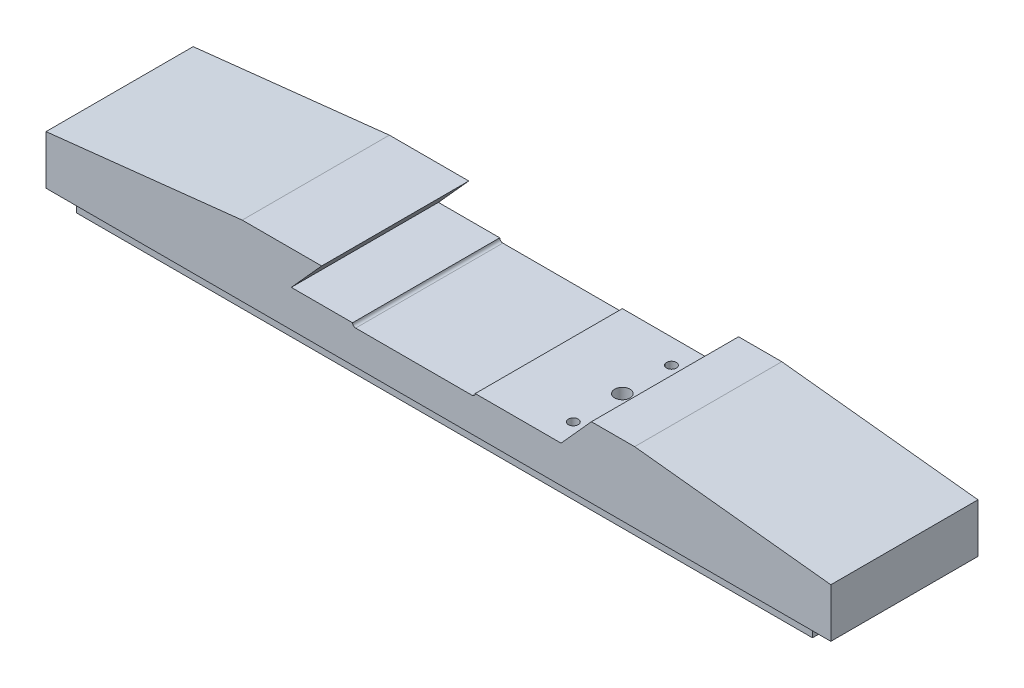
ISO-10303-21;
HEADER;
FILE_DESCRIPTION(('STEP AP214'),'2;1');
FILE_NAME('part.step','',(''),(''),'','','');
FILE_SCHEMA(('AUTOMOTIVE_DESIGN { 1 0 10303 214 1 1 1 1 }'));
ENDSEC;
DATA;
#1=APPLICATION_CONTEXT('core data for automotive mechanical design processes');
#2=APPLICATION_PROTOCOL_DEFINITION('international standard','automotive_design',2000,#1);
#3=PRODUCT_CONTEXT('',#1,'mechanical');
#4=PRODUCT('Part','Part','',(#3));
#5=PRODUCT_RELATED_PRODUCT_CATEGORY('part','',(#4));
#6=PRODUCT_DEFINITION_FORMATION('','',#4);
#7=PRODUCT_DEFINITION_CONTEXT('part definition',#1,'design');
#8=PRODUCT_DEFINITION('design','',#6,#7);
#9=PRODUCT_DEFINITION_SHAPE('','',#8);
#10=(LENGTH_UNIT() NAMED_UNIT(*) SI_UNIT(.MILLI.,.METRE.));
#11=(NAMED_UNIT(*) PLANE_ANGLE_UNIT() SI_UNIT($,.RADIAN.));
#12=(NAMED_UNIT(*) SI_UNIT($,.STERADIAN.) SOLID_ANGLE_UNIT());
#13=UNCERTAINTY_MEASURE_WITH_UNIT(LENGTH_MEASURE(1.E-05),#10,'distance_accuracy_value','');
#14=(GEOMETRIC_REPRESENTATION_CONTEXT(3) GLOBAL_UNCERTAINTY_ASSIGNED_CONTEXT((#13)) GLOBAL_UNIT_ASSIGNED_CONTEXT((#10,
#11,#12)) REPRESENTATION_CONTEXT('',''));
#15=CARTESIAN_POINT('',(0.,0.,0.));
#16=DIRECTION('',(0.,0.,1.));
#17=DIRECTION('',(1.,0.,0.));
#18=AXIS2_PLACEMENT_3D('',#15,#16,#17);
#19=CARTESIAN_POINT('',(406.4,0.,0.));
#20=DIRECTION('',(0.,-1.,0.));
#21=DIRECTION('',(0.,0.,-1.));
#22=AXIS2_PLACEMENT_3D('',#19,#20,#21);
#23=PLANE('',#22);
#24=CARTESIAN_POINT('',(393.7,0.,-65.0875));
#25=DIRECTION('',(0.,-1.,0.));
#26=DIRECTION('',(0.,0.,-1.));
#27=AXIS2_PLACEMENT_3D('',#24,#25,#26);
#28=CIRCLE('',#27,2.55270000000002);
#29=CARTESIAN_POINT('',(393.7,0.,-67.6402));
#30=VERTEX_POINT('',#29);
#31=EDGE_CURVE('E253',#30,#30,#28,.T.);
#32=ORIENTED_EDGE('',*,*,#31,.F.);
#33=EDGE_LOOP('',(#32));
#34=FACE_BOUND('',#33,.T.);
#35=CARTESIAN_POINT('',(393.7,0.,-11.1125));
#36=DIRECTION('',(0.,-1.,0.));
#37=DIRECTION('',(0.,0.,-1.));
#38=AXIS2_PLACEMENT_3D('',#35,#36,#37);
#39=CIRCLE('',#38,2.55270000000002);
#40=CARTESIAN_POINT('',(393.7,0.,-13.6652));
#41=VERTEX_POINT('',#40);
#42=EDGE_CURVE('E259',#41,#41,#39,.T.);
#43=ORIENTED_EDGE('',*,*,#42,.F.);
#44=EDGE_LOOP('',(#43));
#45=FACE_BOUND('',#44,.T.);
#46=DIRECTION('',(-1.,0.,0.));
#47=VECTOR('',#46,1.);
#48=CARTESIAN_POINT('',(381.,0.,-25.4));
#49=LINE('',#48,#47);
#50=CARTESIAN_POINT('',(381.,0.,-25.4));
#51=VERTEX_POINT('',#50);
#52=CARTESIAN_POINT('',(0.,0.,-25.4));
#53=VERTEX_POINT('',#52);
#54=EDGE_CURVE('E291',#51,#53,#49,.T.);
#55=ORIENTED_EDGE('',*,*,#54,.F.);
#56=DIRECTION('',(0.,0.,-1.));
#57=VECTOR('',#56,1.);
#58=CARTESIAN_POINT('',(381.,0.,-25.4));
#59=LINE('',#58,#57);
#60=CARTESIAN_POINT('',(381.,0.,-50.8));
#61=VERTEX_POINT('',#60);
#62=EDGE_CURVE('E269',#51,#61,#59,.T.);
#63=ORIENTED_EDGE('',*,*,#62,.T.);
#64=DIRECTION('',(-1.,0.,0.));
#65=VECTOR('',#64,1.);
#66=CARTESIAN_POINT('',(381.,0.,-50.8));
#67=LINE('',#66,#65);
#68=CARTESIAN_POINT('',(0.,0.,-50.8));
#69=VERTEX_POINT('',#68);
#70=EDGE_CURVE('E324',#61,#69,#67,.T.);
#71=ORIENTED_EDGE('',*,*,#70,.T.);
#72=DIRECTION('',(0.,0.,-1.));
#73=VECTOR('',#72,1.);
#74=CARTESIAN_POINT('',(0.,0.,0.));
#75=LINE('',#74,#73);
#76=CARTESIAN_POINT('',(0.,0.,-76.2));
#77=VERTEX_POINT('',#76);
#78=EDGE_CURVE('E367',#69,#77,#75,.T.);
#79=ORIENTED_EDGE('',*,*,#78,.T.);
#80=DIRECTION('',(-1.,0.,0.));
#81=VECTOR('',#80,1.);
#82=CARTESIAN_POINT('',(406.4,0.,-76.2));
#83=LINE('',#82,#81);
#84=CARTESIAN_POINT('',(406.4,0.,-76.2));
#85=VERTEX_POINT('',#84);
#86=EDGE_CURVE('E313',#85,#77,#83,.T.);
#87=ORIENTED_EDGE('',*,*,#86,.F.);
#88=DIRECTION('',(0.,0.,-1.));
#89=VECTOR('',#88,1.);
#90=CARTESIAN_POINT('',(406.4,0.,0.));
#91=LINE('',#90,#89);
#92=CARTESIAN_POINT('',(406.4,0.,0.));
#93=VERTEX_POINT('',#92);
#94=EDGE_CURVE('E403',#93,#85,#91,.T.);
#95=ORIENTED_EDGE('',*,*,#94,.F.);
#96=DIRECTION('',(-1.,0.,0.));
#97=VECTOR('',#96,1.);
#98=CARTESIAN_POINT('',(406.4,0.,0.));
#99=LINE('',#98,#97);
#100=CARTESIAN_POINT('',(0.,0.,0.));
#101=VERTEX_POINT('',#100);
#102=EDGE_CURVE('E328',#93,#101,#99,.T.);
#103=ORIENTED_EDGE('',*,*,#102,.T.);
#104=EDGE_CURVE('E427',#101,#53,#75,.T.);
#105=ORIENTED_EDGE('',*,*,#104,.T.);
#106=EDGE_LOOP('',(#55,#63,#71,#79,#87,#95,#103,#105));
#107=FACE_BOUND('',#106,.T.);
#108=ADVANCED_FACE('F47',(#34,#45,#107),#23,.T.);
#109=CARTESIAN_POINT('',(406.4,25.4,0.));
#110=DIRECTION('',(1.,0.,0.));
#111=DIRECTION('',(0.,0.,-1.));
#112=AXIS2_PLACEMENT_3D('',#109,#110,#111);
#113=PLANE('',#112);
#114=DIRECTION('',(0.,-1.,0.));
#115=VECTOR('',#114,1.);
#116=CARTESIAN_POINT('',(406.4,25.4,-76.2));
#117=LINE('',#116,#115);
#118=CARTESIAN_POINT('',(406.4,25.4,-76.2));
#119=VERTEX_POINT('',#118);
#120=EDGE_CURVE('E332',#119,#85,#117,.T.);
#121=ORIENTED_EDGE('',*,*,#120,.F.);
#122=DIRECTION('',(0.,0.,-1.));
#123=VECTOR('',#122,1.);
#124=CARTESIAN_POINT('',(406.4,25.4,0.));
#125=LINE('',#124,#123);
#126=CARTESIAN_POINT('',(406.4,25.4,0.));
#127=VERTEX_POINT('',#126);
#128=EDGE_CURVE('E406',#127,#119,#125,.T.);
#129=ORIENTED_EDGE('',*,*,#128,.F.);
#130=DIRECTION('',(0.,-1.,0.));
#131=VECTOR('',#130,1.);
#132=CARTESIAN_POINT('',(406.4,25.4,0.));
#133=LINE('',#132,#131);
#134=EDGE_CURVE('E364',#127,#93,#133,.T.);
#135=ORIENTED_EDGE('',*,*,#134,.T.);
#136=ORIENTED_EDGE('',*,*,#94,.T.);
#137=EDGE_LOOP('',(#121,#129,#135,#136));
#138=FACE_BOUND('',#137,.T.);
#139=ADVANCED_FACE('F456',(#138),#113,.T.);
#140=CARTESIAN_POINT('',(284.429433487709,38.7405307122818,0.));
#141=DIRECTION('',(0.108726591285635,0.994071691754376,0.));
#142=DIRECTION('',(-0.994071691754376,0.108726591285635,0.));
#143=AXIS2_PLACEMENT_3D('',#140,#141,#142);
#144=PLANE('',#143);
#145=DIRECTION('',(0.994071691754376,-0.108726591285635,0.));
#146=VECTOR('',#145,1.);
#147=CARTESIAN_POINT('',(284.429433487709,38.7405307122818,-76.2));
#148=LINE('',#147,#146);
#149=CARTESIAN_POINT('',(304.800000000001,36.5124999999999,-76.2));
#150=VERTEX_POINT('',#149);
#151=EDGE_CURVE('E399',#150,#119,#148,.T.);
#152=ORIENTED_EDGE('',*,*,#151,.F.);
#153=DIRECTION('',(0.,0.,1.));
#154=VECTOR('',#153,1.);
#155=CARTESIAN_POINT('',(304.800000000001,36.5124999999999,0.));
#156=LINE('',#155,#154);
#157=CARTESIAN_POINT('',(304.800000000001,36.5124999999999,0.));
#158=VERTEX_POINT('',#157);
#159=EDGE_CURVE('E56',#150,#158,#156,.T.);
#160=ORIENTED_EDGE('',*,*,#159,.T.);
#161=DIRECTION('',(0.994071691754376,-0.108726591285635,0.));
#162=VECTOR('',#161,1.);
#163=CARTESIAN_POINT('',(284.429433487709,38.7405307122818,0.));
#164=LINE('',#163,#162);
#165=EDGE_CURVE('E362',#158,#127,#164,.T.);
#166=ORIENTED_EDGE('',*,*,#165,.T.);
#167=ORIENTED_EDGE('',*,*,#128,.T.);
#168=EDGE_LOOP('',(#152,#160,#166,#167));
#169=FACE_BOUND('',#168,.T.);
#170=ADVANCED_FACE('F463',(#169),#144,.T.);
#171=CARTESIAN_POINT('',(266.7,19.05,0.));
#172=DIRECTION('',(-0.743144825477392,0.669130606358861,0.));
#173=DIRECTION('',(-0.669130606358861,-0.743144825477392,0.));
#174=AXIS2_PLACEMENT_3D('',#171,#172,#173);
#175=PLANE('',#174);
#176=DIRECTION('',(0.669130606358861,0.743144825477392,0.));
#177=VECTOR('',#176,1.);
#178=CARTESIAN_POINT('',(266.7,19.05,0.));
#179=LINE('',#178,#177);
#180=CARTESIAN_POINT('',(266.7,19.05,0.));
#181=VERTEX_POINT('',#180);
#182=CARTESIAN_POINT('',(282.423305623551,36.5125,0.));
#183=VERTEX_POINT('',#182);
#184=EDGE_CURVE('E359',#181,#183,#179,.T.);
#185=ORIENTED_EDGE('',*,*,#184,.T.);
#186=DIRECTION('',(0.,0.,-1.));
#187=VECTOR('',#186,1.);
#188=CARTESIAN_POINT('',(282.423305623551,36.5125,0.));
#189=LINE('',#188,#187);
#190=CARTESIAN_POINT('',(282.423305623551,36.5125,-76.2));
#191=VERTEX_POINT('',#190);
#192=EDGE_CURVE('E405',#183,#191,#189,.T.);
#193=ORIENTED_EDGE('',*,*,#192,.T.);
#194=DIRECTION('',(0.669130606358861,0.743144825477392,0.));
#195=VECTOR('',#194,1.);
#196=CARTESIAN_POINT('',(266.7,19.05,-76.2));
#197=LINE('',#196,#195);
#198=CARTESIAN_POINT('',(266.7,19.05,-76.2));
#199=VERTEX_POINT('',#198);
#200=EDGE_CURVE('E397',#199,#191,#197,.T.);
#201=ORIENTED_EDGE('',*,*,#200,.F.);
#202=DIRECTION('',(0.,0.,-1.));
#203=VECTOR('',#202,1.);
#204=CARTESIAN_POINT('',(266.7,19.05,0.));
#205=LINE('',#204,#203);
#206=EDGE_CURVE('E409',#181,#199,#205,.T.);
#207=ORIENTED_EDGE('',*,*,#206,.F.);
#208=EDGE_LOOP('',(#185,#193,#201,#207));
#209=FACE_BOUND('',#208,.T.);
#210=ADVANCED_FACE('F435',(#209),#175,.T.);
#211=CARTESIAN_POINT('',(222.25,19.05,0.));
#212=DIRECTION('',(0.,1.,0.));
#213=DIRECTION('',(-1.,0.,0.));
#214=AXIS2_PLACEMENT_3D('',#211,#212,#213);
#215=PLANE('',#214);
#216=CARTESIAN_POINT('',(260.35,19.05,-12.7));
#217=DIRECTION('',(0.,1.,0.));
#218=DIRECTION('',(0.,0.,1.));
#219=AXIS2_PLACEMENT_3D('',#216,#217,#218);
#220=CIRCLE('',#219,2.55270000000002);
#221=CARTESIAN_POINT('',(260.35,19.05,-10.1473));
#222=VERTEX_POINT('',#221);
#223=EDGE_CURVE('E225',#222,#222,#220,.T.);
#224=ORIENTED_EDGE('',*,*,#223,.F.);
#225=EDGE_LOOP('',(#224));
#226=FACE_BOUND('',#225,.T.);
#227=CARTESIAN_POINT('',(260.35,19.05,-63.5));
#228=DIRECTION('',(0.,1.,0.));
#229=DIRECTION('',(0.,0.,1.));
#230=AXIS2_PLACEMENT_3D('',#227,#228,#229);
#231=CIRCLE('',#230,2.55270000000002);
#232=CARTESIAN_POINT('',(260.35,19.05,-60.9473));
#233=VERTEX_POINT('',#232);
#234=EDGE_CURVE('E224',#233,#233,#231,.T.);
#235=ORIENTED_EDGE('',*,*,#234,.F.);
#236=EDGE_LOOP('',(#235));
#237=FACE_BOUND('',#236,.T.);
#238=CARTESIAN_POINT('',(260.35,19.05,-38.1));
#239=DIRECTION('',(0.,1.,0.));
#240=DIRECTION('',(0.,0.,1.));
#241=AXIS2_PLACEMENT_3D('',#238,#239,#240);
#242=CIRCLE('',#241,3.96875000000002);
#243=CARTESIAN_POINT('',(260.35,19.05,-34.13125));
#244=VERTEX_POINT('',#243);
#245=EDGE_CURVE('E235',#244,#244,#242,.T.);
#246=ORIENTED_EDGE('',*,*,#245,.F.);
#247=EDGE_LOOP('',(#246));
#248=FACE_BOUND('',#247,.T.);
#249=DIRECTION('',(1.,0.,0.));
#250=VECTOR('',#249,1.);
#251=CARTESIAN_POINT('',(222.25,19.05,-76.2));
#252=LINE('',#251,#250);
#253=CARTESIAN_POINT('',(222.25,19.05,-76.2));
#254=VERTEX_POINT('',#253);
#255=EDGE_CURVE('E394',#254,#199,#252,.T.);
#256=ORIENTED_EDGE('',*,*,#255,.F.);
#257=DIRECTION('',(0.,0.,-1.));
#258=VECTOR('',#257,1.);
#259=CARTESIAN_POINT('',(222.25,19.05,0.));
#260=LINE('',#259,#258);
#261=CARTESIAN_POINT('',(222.25,19.05,0.));
#262=VERTEX_POINT('',#261);
#263=EDGE_CURVE('E411',#262,#254,#260,.T.);
#264=ORIENTED_EDGE('',*,*,#263,.F.);
#265=DIRECTION('',(1.,0.,0.));
#266=VECTOR('',#265,1.);
#267=CARTESIAN_POINT('',(222.25,19.05,0.));
#268=LINE('',#267,#266);
#269=EDGE_CURVE('E356',#262,#181,#268,.T.);
#270=ORIENTED_EDGE('',*,*,#269,.T.);
#271=ORIENTED_EDGE('',*,*,#206,.T.);
#272=EDGE_LOOP('',(#256,#264,#270,#271));
#273=FACE_BOUND('',#272,.T.);
#274=ADVANCED_FACE('F443',(#226,#237,#248,#273),#215,.T.);
#275=CARTESIAN_POINT('',(220.6625,19.05,0.));
#276=DIRECTION('',(0.,0.,-1.));
#277=DIRECTION('',(-1.,0.,0.));
#278=AXIS2_PLACEMENT_3D('',#275,#276,#277);
#279=CYLINDRICAL_SURFACE('',#278,1.5875);
#280=CARTESIAN_POINT('',(220.6625,19.05,-76.2));
#281=DIRECTION('',(0.,0.,1.));
#282=DIRECTION('',(1.,0.,0.));
#283=AXIS2_PLACEMENT_3D('',#280,#281,#282);
#284=CIRCLE('',#283,1.5875);
#285=CARTESIAN_POINT('',(220.6625,17.4625,-76.2));
#286=VERTEX_POINT('',#285);
#287=EDGE_CURVE('E391',#286,#254,#284,.T.);
#288=ORIENTED_EDGE('',*,*,#287,.F.);
#289=DIRECTION('',(0.,0.,-1.));
#290=VECTOR('',#289,1.);
#291=CARTESIAN_POINT('',(220.6625,17.4625,0.));
#292=LINE('',#291,#290);
#293=CARTESIAN_POINT('',(220.6625,17.4625,0.));
#294=VERTEX_POINT('',#293);
#295=EDGE_CURVE('E413',#294,#286,#292,.T.);
#296=ORIENTED_EDGE('',*,*,#295,.F.);
#297=CARTESIAN_POINT('',(220.6625,19.05,0.));
#298=DIRECTION('',(0.,0.,1.));
#299=DIRECTION('',(1.,0.,0.));
#300=AXIS2_PLACEMENT_3D('',#297,#298,#299);
#301=CIRCLE('',#300,1.5875);
#302=EDGE_CURVE('E353',#294,#262,#301,.T.);
#303=ORIENTED_EDGE('',*,*,#302,.T.);
#304=ORIENTED_EDGE('',*,*,#263,.T.);
#305=EDGE_LOOP('',(#288,#296,#303,#304));
#306=FACE_BOUND('',#305,.T.);
#307=ADVANCED_FACE('F496',(#306),#279,.F.);
#308=CARTESIAN_POINT('',(160.3375,17.4625,0.));
#309=DIRECTION('',(0.,1.,0.));
#310=DIRECTION('',(-1.,0.,0.));
#311=AXIS2_PLACEMENT_3D('',#308,#309,#310);
#312=PLANE('',#311);
#313=DIRECTION('',(1.,0.,0.));
#314=VECTOR('',#313,1.);
#315=CARTESIAN_POINT('',(160.3375,17.4625,-76.2));
#316=LINE('',#315,#314);
#317=CARTESIAN_POINT('',(160.3375,17.4625,-76.2));
#318=VERTEX_POINT('',#317);
#319=EDGE_CURVE('E388',#318,#286,#316,.T.);
#320=ORIENTED_EDGE('',*,*,#319,.F.);
#321=DIRECTION('',(0.,0.,-1.));
#322=VECTOR('',#321,1.);
#323=CARTESIAN_POINT('',(160.3375,17.4625,0.));
#324=LINE('',#323,#322);
#325=CARTESIAN_POINT('',(160.3375,17.4625,0.));
#326=VERTEX_POINT('',#325);
#327=EDGE_CURVE('E415',#326,#318,#324,.T.);
#328=ORIENTED_EDGE('',*,*,#327,.F.);
#329=DIRECTION('',(1.,0.,0.));
#330=VECTOR('',#329,1.);
#331=CARTESIAN_POINT('',(160.3375,17.4625,0.));
#332=LINE('',#331,#330);
#333=EDGE_CURVE('E350',#326,#294,#332,.T.);
#334=ORIENTED_EDGE('',*,*,#333,.T.);
#335=ORIENTED_EDGE('',*,*,#295,.T.);
#336=EDGE_LOOP('',(#320,#328,#334,#335));
#337=FACE_BOUND('',#336,.T.);
#338=ADVANCED_FACE('F492',(#337),#312,.T.);
#339=CARTESIAN_POINT('',(160.3375,19.05,0.));
#340=DIRECTION('',(0.,0.,-1.));
#341=DIRECTION('',(-1.,0.,0.));
#342=AXIS2_PLACEMENT_3D('',#339,#340,#341);
#343=CYLINDRICAL_SURFACE('',#342,1.5875);
#344=CARTESIAN_POINT('',(160.3375,19.05,-76.2));
#345=DIRECTION('',(0.,0.,1.));
#346=DIRECTION('',(1.,0.,0.));
#347=AXIS2_PLACEMENT_3D('',#344,#345,#346);
#348=CIRCLE('',#347,1.5875);
#349=CARTESIAN_POINT('',(158.75,19.05,-76.2));
#350=VERTEX_POINT('',#349);
#351=EDGE_CURVE('E385',#350,#318,#348,.T.);
#352=ORIENTED_EDGE('',*,*,#351,.F.);
#353=DIRECTION('',(0.,0.,-1.));
#354=VECTOR('',#353,1.);
#355=CARTESIAN_POINT('',(158.75,19.05,0.));
#356=LINE('',#355,#354);
#357=CARTESIAN_POINT('',(158.75,19.05,0.));
#358=VERTEX_POINT('',#357);
#359=EDGE_CURVE('E417',#358,#350,#356,.T.);
#360=ORIENTED_EDGE('',*,*,#359,.F.);
#361=CARTESIAN_POINT('',(160.3375,19.05,0.));
#362=DIRECTION('',(0.,0.,1.));
#363=DIRECTION('',(1.,0.,0.));
#364=AXIS2_PLACEMENT_3D('',#361,#362,#363);
#365=CIRCLE('',#364,1.5875);
#366=EDGE_CURVE('E347',#358,#326,#365,.T.);
#367=ORIENTED_EDGE('',*,*,#366,.T.);
#368=ORIENTED_EDGE('',*,*,#327,.T.);
#369=EDGE_LOOP('',(#352,#360,#367,#368));
#370=FACE_BOUND('',#369,.T.);
#371=ADVANCED_FACE('F488',(#370),#343,.F.);
#372=CARTESIAN_POINT('',(127.,19.05,0.));
#373=DIRECTION('',(0.,1.,0.));
#374=DIRECTION('',(-1.,0.,0.));
#375=AXIS2_PLACEMENT_3D('',#372,#373,#374);
#376=PLANE('',#375);
#377=DIRECTION('',(1.,0.,0.));
#378=VECTOR('',#377,1.);
#379=CARTESIAN_POINT('',(127.,19.05,-76.2));
#380=LINE('',#379,#378);
#381=CARTESIAN_POINT('',(127.,19.05,-76.2));
#382=VERTEX_POINT('',#381);
#383=EDGE_CURVE('E382',#382,#350,#380,.T.);
#384=ORIENTED_EDGE('',*,*,#383,.F.);
#385=DIRECTION('',(0.,0.,-1.));
#386=VECTOR('',#385,1.);
#387=CARTESIAN_POINT('',(127.,19.05,0.));
#388=LINE('',#387,#386);
#389=CARTESIAN_POINT('',(127.,19.05,0.));
#390=VERTEX_POINT('',#389);
#391=EDGE_CURVE('E419',#390,#382,#388,.T.);
#392=ORIENTED_EDGE('',*,*,#391,.F.);
#393=DIRECTION('',(1.,0.,0.));
#394=VECTOR('',#393,1.);
#395=CARTESIAN_POINT('',(127.,19.05,0.));
#396=LINE('',#395,#394);
#397=EDGE_CURVE('E344',#390,#358,#396,.T.);
#398=ORIENTED_EDGE('',*,*,#397,.T.);
#399=ORIENTED_EDGE('',*,*,#359,.T.);
#400=EDGE_LOOP('',(#384,#392,#398,#399));
#401=FACE_BOUND('',#400,.T.);
#402=ADVANCED_FACE('F484',(#401),#376,.T.);
#403=CARTESIAN_POINT('',(142.723305623551,36.5125,0.));
#404=DIRECTION('',(0.743144825477391,-0.669130606358862,0.));
#405=DIRECTION('',(0.669130606358862,0.743144825477391,0.));
#406=AXIS2_PLACEMENT_3D('',#403,#404,#405);
#407=PLANE('',#406);
#408=DIRECTION('',(-0.669130606358862,-0.743144825477391,0.));
#409=VECTOR('',#408,1.);
#410=CARTESIAN_POINT('',(142.723305623551,36.5125,-76.2));
#411=LINE('',#410,#409);
#412=CARTESIAN_POINT('',(142.723305623551,36.5125,-76.2));
#413=VERTEX_POINT('',#412);
#414=EDGE_CURVE('E379',#413,#382,#411,.T.);
#415=ORIENTED_EDGE('',*,*,#414,.F.);
#416=DIRECTION('',(0.,0.,-1.));
#417=VECTOR('',#416,1.);
#418=CARTESIAN_POINT('',(142.723305623551,36.5125,0.));
#419=LINE('',#418,#417);
#420=CARTESIAN_POINT('',(142.723305623551,36.5125,0.));
#421=VERTEX_POINT('',#420);
#422=EDGE_CURVE('E421',#421,#413,#419,.T.);
#423=ORIENTED_EDGE('',*,*,#422,.F.);
#424=DIRECTION('',(-0.669130606358862,-0.743144825477391,0.));
#425=VECTOR('',#424,1.);
#426=CARTESIAN_POINT('',(142.723305623551,36.5125,0.));
#427=LINE('',#426,#425);
#428=EDGE_CURVE('E341',#421,#390,#427,.T.);
#429=ORIENTED_EDGE('',*,*,#428,.T.);
#430=ORIENTED_EDGE('',*,*,#391,.T.);
#431=EDGE_LOOP('',(#415,#423,#429,#430));
#432=FACE_BOUND('',#431,.T.);
#433=ADVANCED_FACE('F480',(#432),#407,.T.);
#434=CARTESIAN_POINT('',(101.6,36.5125,0.));
#435=DIRECTION('',(0.,1.,0.));
#436=DIRECTION('',(-1.,0.,0.));
#437=AXIS2_PLACEMENT_3D('',#434,#435,#436);
#438=PLANE('',#437);
#439=DIRECTION('',(1.,0.,0.));
#440=VECTOR('',#439,1.);
#441=CARTESIAN_POINT('',(101.6,36.5125,-76.2));
#442=LINE('',#441,#440);
#443=CARTESIAN_POINT('',(101.6,36.5125,-76.2));
#444=VERTEX_POINT('',#443);
#445=EDGE_CURVE('E376',#444,#413,#442,.T.);
#446=ORIENTED_EDGE('',*,*,#445,.F.);
#447=DIRECTION('',(0.,0.,-1.));
#448=VECTOR('',#447,1.);
#449=CARTESIAN_POINT('',(101.6,36.5125,0.));
#450=LINE('',#449,#448);
#451=CARTESIAN_POINT('',(101.6,36.5125,0.));
#452=VERTEX_POINT('',#451);
#453=EDGE_CURVE('E423',#452,#444,#450,.T.);
#454=ORIENTED_EDGE('',*,*,#453,.F.);
#455=DIRECTION('',(1.,0.,0.));
#456=VECTOR('',#455,1.);
#457=CARTESIAN_POINT('',(101.6,36.5125,0.));
#458=LINE('',#457,#456);
#459=EDGE_CURVE('E338',#452,#421,#458,.T.);
#460=ORIENTED_EDGE('',*,*,#459,.T.);
#461=ORIENTED_EDGE('',*,*,#422,.T.);
#462=EDGE_LOOP('',(#446,#454,#460,#461));
#463=FACE_BOUND('',#462,.T.);
#464=ADVANCED_FACE('F476',(#463),#438,.T.);
#465=CARTESIAN_POINT('',(0.,25.4,0.));
#466=DIRECTION('',(-0.108726591285635,0.994071691754376,0.));
#467=DIRECTION('',(-0.994071691754376,-0.108726591285635,0.));
#468=AXIS2_PLACEMENT_3D('',#465,#466,#467);
#469=PLANE('',#468);
#470=DIRECTION('',(0.994071691754376,0.108726591285635,0.));
#471=VECTOR('',#470,1.);
#472=CARTESIAN_POINT('',(0.,25.4,-76.2));
#473=LINE('',#472,#471);
#474=CARTESIAN_POINT('',(0.,25.4,-76.2));
#475=VERTEX_POINT('',#474);
#476=EDGE_CURVE('E373',#475,#444,#473,.T.);
#477=ORIENTED_EDGE('',*,*,#476,.F.);
#478=DIRECTION('',(0.,0.,-1.));
#479=VECTOR('',#478,1.);
#480=CARTESIAN_POINT('',(0.,25.4,0.));
#481=LINE('',#480,#479);
#482=CARTESIAN_POINT('',(0.,25.4,0.));
#483=VERTEX_POINT('',#482);
#484=EDGE_CURVE('E425',#483,#475,#481,.T.);
#485=ORIENTED_EDGE('',*,*,#484,.F.);
#486=DIRECTION('',(0.994071691754376,0.108726591285635,0.));
#487=VECTOR('',#486,1.);
#488=CARTESIAN_POINT('',(0.,25.4,0.));
#489=LINE('',#488,#487);
#490=EDGE_CURVE('E335',#483,#452,#489,.T.);
#491=ORIENTED_EDGE('',*,*,#490,.T.);
#492=ORIENTED_EDGE('',*,*,#453,.T.);
#493=EDGE_LOOP('',(#477,#485,#491,#492));
#494=FACE_BOUND('',#493,.T.);
#495=ADVANCED_FACE('F472',(#494),#469,.T.);
#496=CARTESIAN_POINT('',(0.,0.,0.));
#497=DIRECTION('',(-1.,0.,0.));
#498=DIRECTION('',(0.,-1.,0.));
#499=AXIS2_PLACEMENT_3D('',#496,#497,#498);
#500=PLANE('',#499);
#501=DIRECTION('',(0.,1.,0.));
#502=VECTOR('',#501,1.);
#503=CARTESIAN_POINT('',(0.,0.,-76.2));
#504=LINE('',#503,#502);
#505=EDGE_CURVE('E370',#77,#475,#504,.T.);
#506=ORIENTED_EDGE('',*,*,#505,.F.);
#507=ORIENTED_EDGE('',*,*,#78,.F.);
#508=DIRECTION('',(0.,-1.,0.));
#509=VECTOR('',#508,1.);
#510=CARTESIAN_POINT('',(0.,0.,-50.8));
#511=LINE('',#510,#509);
#512=CARTESIAN_POINT('',(0.,-9.52499999999999,-50.8));
#513=VERTEX_POINT('',#512);
#514=EDGE_CURVE('E294',#69,#513,#511,.T.);
#515=ORIENTED_EDGE('',*,*,#514,.T.);
#516=DIRECTION('',(0.,0.,-1.));
#517=VECTOR('',#516,1.);
#518=CARTESIAN_POINT('',(0.,-9.52499999999999,-50.8));
#519=LINE('',#518,#517);
#520=CARTESIAN_POINT('',(0.,-9.52499999999999,-60.325));
#521=VERTEX_POINT('',#520);
#522=EDGE_CURVE('E297',#513,#521,#519,.T.);
#523=ORIENTED_EDGE('',*,*,#522,.T.);
#524=DIRECTION('',(0.,-1.,0.));
#525=VECTOR('',#524,1.);
#526=CARTESIAN_POINT('',(0.,-9.52499999999999,-60.325));
#527=LINE('',#526,#525);
#528=CARTESIAN_POINT('',(0.,-19.05,-60.325));
#529=VERTEX_POINT('',#528);
#530=EDGE_CURVE('E300',#521,#529,#527,.T.);
#531=ORIENTED_EDGE('',*,*,#530,.T.);
#532=DIRECTION('',(0.,0.,1.));
#533=VECTOR('',#532,1.);
#534=CARTESIAN_POINT('',(0.,-19.05,-60.325));
#535=LINE('',#534,#533);
#536=CARTESIAN_POINT('',(0.,-19.05,-15.875));
#537=VERTEX_POINT('',#536);
#538=EDGE_CURVE('E303',#529,#537,#535,.T.);
#539=ORIENTED_EDGE('',*,*,#538,.T.);
#540=DIRECTION('',(0.,1.,0.));
#541=VECTOR('',#540,1.);
#542=CARTESIAN_POINT('',(0.,-19.05,-15.875));
#543=LINE('',#542,#541);
#544=CARTESIAN_POINT('',(0.,-9.525,-15.875));
#545=VERTEX_POINT('',#544);
#546=EDGE_CURVE('E306',#537,#545,#543,.T.);
#547=ORIENTED_EDGE('',*,*,#546,.T.);
#548=DIRECTION('',(0.,0.,-1.));
#549=VECTOR('',#548,1.);
#550=CARTESIAN_POINT('',(0.,-9.525,-15.875));
#551=LINE('',#550,#549);
#552=CARTESIAN_POINT('',(0.,-9.525,-25.4));
#553=VERTEX_POINT('',#552);
#554=EDGE_CURVE('E270',#545,#553,#551,.T.);
#555=ORIENTED_EDGE('',*,*,#554,.T.);
#556=DIRECTION('',(0.,1.,0.));
#557=VECTOR('',#556,1.);
#558=CARTESIAN_POINT('',(0.,-9.525,-25.4));
#559=LINE('',#558,#557);
#560=EDGE_CURVE('E265',#553,#53,#559,.T.);
#561=ORIENTED_EDGE('',*,*,#560,.T.);
#562=ORIENTED_EDGE('',*,*,#104,.F.);
#563=DIRECTION('',(0.,1.,0.));
#564=VECTOR('',#563,1.);
#565=CARTESIAN_POINT('',(0.,0.,0.));
#566=LINE('',#565,#564);
#567=EDGE_CURVE('E331',#101,#483,#566,.T.);
#568=ORIENTED_EDGE('',*,*,#567,.T.);
#569=ORIENTED_EDGE('',*,*,#484,.T.);
#570=EDGE_LOOP('',(#506,#507,#515,#523,#531,#539,#547,#555,#561,#562,#568,#569));
#571=FACE_BOUND('',#570,.T.);
#572=ADVANCED_FACE('F469',(#571),#500,.T.);
#573=CARTESIAN_POINT('',(160.3375,19.05,0.));
#574=DIRECTION('',(0.,0.,1.));
#575=DIRECTION('',(1.,0.,0.));
#576=AXIS2_PLACEMENT_3D('',#573,#574,#575);
#577=PLANE('',#576);
#578=ORIENTED_EDGE('',*,*,#165,.F.);
#579=DIRECTION('',(1.,0.,0.));
#580=VECTOR('',#579,1.);
#581=CARTESIAN_POINT('',(160.3375,36.5125000000003,0.));
#582=LINE('',#581,#580);
#583=EDGE_CURVE('E11',#158,#183,#582,.F.);
#584=ORIENTED_EDGE('',*,*,#583,.T.);
#585=ORIENTED_EDGE('',*,*,#184,.F.);
#586=ORIENTED_EDGE('',*,*,#269,.F.);
#587=ORIENTED_EDGE('',*,*,#302,.F.);
#588=ORIENTED_EDGE('',*,*,#333,.F.);
#589=ORIENTED_EDGE('',*,*,#366,.F.);
#590=ORIENTED_EDGE('',*,*,#397,.F.);
#591=ORIENTED_EDGE('',*,*,#428,.F.);
#592=ORIENTED_EDGE('',*,*,#459,.F.);
#593=ORIENTED_EDGE('',*,*,#490,.F.);
#594=ORIENTED_EDGE('',*,*,#567,.F.);
#595=ORIENTED_EDGE('',*,*,#102,.F.);
#596=ORIENTED_EDGE('',*,*,#134,.F.);
#597=EDGE_LOOP('',(#578,#584,#585,#586,#587,#588,#589,#590,#591,#592,#593,#594,#595,#596));
#598=FACE_BOUND('',#597,.T.);
#599=ADVANCED_FACE('F446',(#598),#577,.T.);
#600=CARTESIAN_POINT('',(160.3375,19.05,-76.2));
#601=DIRECTION('',(0.,0.,1.));
#602=DIRECTION('',(1.,0.,0.));
#603=AXIS2_PLACEMENT_3D('',#600,#601,#602);
#604=PLANE('',#603);
#605=CARTESIAN_POINT('',(139.7,9.52500000000003,-76.2));
#606=DIRECTION('',(0.,0.,-1.));
#607=DIRECTION('',(-1.,0.,0.));
#608=AXIS2_PLACEMENT_3D('',#605,#606,#607);
#609=CIRCLE('',#608,2.55269999999999);
#610=CARTESIAN_POINT('',(137.1473,9.52500000000003,-76.2));
#611=VERTEX_POINT('',#610);
#612=EDGE_CURVE('E241',#611,#611,#609,.T.);
#613=ORIENTED_EDGE('',*,*,#612,.F.);
#614=EDGE_LOOP('',(#613));
#615=FACE_BOUND('',#614,.T.);
#616=CARTESIAN_POINT('',(241.3,9.52500000000001,-76.2));
#617=DIRECTION('',(0.,0.,-1.));
#618=DIRECTION('',(-1.,0.,0.));
#619=AXIS2_PLACEMENT_3D('',#616,#617,#618);
#620=CIRCLE('',#619,2.55269999999999);
#621=CARTESIAN_POINT('',(238.7473,9.52500000000001,-76.2));
#622=VERTEX_POINT('',#621);
#623=EDGE_CURVE('E247',#622,#622,#620,.T.);
#624=ORIENTED_EDGE('',*,*,#623,.F.);
#625=EDGE_LOOP('',(#624));
#626=FACE_BOUND('',#625,.T.);
#627=ORIENTED_EDGE('',*,*,#200,.T.);
#628=DIRECTION('',(-1.,0.,0.));
#629=VECTOR('',#628,1.);
#630=CARTESIAN_POINT('',(282.423305623551,36.5125,-76.2));
#631=LINE('',#630,#629);
#632=EDGE_CURVE('E70',#191,#150,#631,.F.);
#633=ORIENTED_EDGE('',*,*,#632,.T.);
#634=ORIENTED_EDGE('',*,*,#151,.T.);
#635=ORIENTED_EDGE('',*,*,#120,.T.);
#636=ORIENTED_EDGE('',*,*,#86,.T.);
#637=ORIENTED_EDGE('',*,*,#505,.T.);
#638=ORIENTED_EDGE('',*,*,#476,.T.);
#639=ORIENTED_EDGE('',*,*,#445,.T.);
#640=ORIENTED_EDGE('',*,*,#414,.T.);
#641=ORIENTED_EDGE('',*,*,#383,.T.);
#642=ORIENTED_EDGE('',*,*,#351,.T.);
#643=ORIENTED_EDGE('',*,*,#319,.T.);
#644=ORIENTED_EDGE('',*,*,#287,.T.);
#645=ORIENTED_EDGE('',*,*,#255,.T.);
#646=EDGE_LOOP('',(#627,#633,#634,#635,#636,#637,#638,#639,#640,#641,#642,#643,#644,#645));
#647=FACE_BOUND('',#646,.T.);
#648=ADVANCED_FACE('F439',(#615,#626,#647),#604,.F.);
#649=CARTESIAN_POINT('',(381.,-9.52499999999997,-25.4));
#650=DIRECTION('',(0.,0.,1.));
#651=DIRECTION('',(1.,0.,0.));
#652=AXIS2_PLACEMENT_3D('',#649,#650,#651);
#653=PLANE('',#652);
#654=ORIENTED_EDGE('',*,*,#560,.F.);
#655=DIRECTION('',(-1.,0.,0.));
#656=VECTOR('',#655,1.);
#657=CARTESIAN_POINT('',(381.,-9.52499999999997,-25.4));
#658=LINE('',#657,#656);
#659=CARTESIAN_POINT('',(381.,-9.52499999999997,-25.4));
#660=VERTEX_POINT('',#659);
#661=EDGE_CURVE('E311',#660,#553,#658,.T.);
#662=ORIENTED_EDGE('',*,*,#661,.F.);
#663=DIRECTION('',(0.,1.,0.));
#664=VECTOR('',#663,1.);
#665=CARTESIAN_POINT('',(381.,-9.52499999999997,-25.4));
#666=LINE('',#665,#664);
#667=EDGE_CURVE('E266',#660,#51,#666,.T.);
#668=ORIENTED_EDGE('',*,*,#667,.T.);
#669=ORIENTED_EDGE('',*,*,#54,.T.);
#670=EDGE_LOOP('',(#654,#662,#668,#669));
#671=FACE_BOUND('',#670,.T.);
#672=ADVANCED_FACE('F509',(#671),#653,.T.);
#673=CARTESIAN_POINT('',(381.,-9.52499999999997,-15.875));
#674=DIRECTION('',(0.,1.,0.));
#675=DIRECTION('',(0.,0.,1.));
#676=AXIS2_PLACEMENT_3D('',#673,#674,#675);
#677=PLANE('',#676);
#678=ORIENTED_EDGE('',*,*,#554,.F.);
#679=DIRECTION('',(-1.,0.,0.));
#680=VECTOR('',#679,1.);
#681=CARTESIAN_POINT('',(381.,-9.52499999999997,-15.875));
#682=LINE('',#681,#680);
#683=CARTESIAN_POINT('',(381.,-9.52499999999997,-15.875));
#684=VERTEX_POINT('',#683);
#685=EDGE_CURVE('E314',#684,#545,#682,.T.);
#686=ORIENTED_EDGE('',*,*,#685,.F.);
#687=DIRECTION('',(0.,0.,-1.));
#688=VECTOR('',#687,1.);
#689=CARTESIAN_POINT('',(381.,-9.52499999999997,-15.875));
#690=LINE('',#689,#688);
#691=EDGE_CURVE('E288',#684,#660,#690,.T.);
#692=ORIENTED_EDGE('',*,*,#691,.T.);
#693=ORIENTED_EDGE('',*,*,#661,.T.);
#694=EDGE_LOOP('',(#678,#686,#692,#693));
#695=FACE_BOUND('',#694,.T.);
#696=ADVANCED_FACE('F515',(#695),#677,.T.);
#697=CARTESIAN_POINT('',(381.,-19.05,-15.875));
#698=DIRECTION('',(0.,0.,1.));
#699=DIRECTION('',(1.,0.,0.));
#700=AXIS2_PLACEMENT_3D('',#697,#698,#699);
#701=PLANE('',#700);
#702=ORIENTED_EDGE('',*,*,#546,.F.);
#703=DIRECTION('',(-1.,0.,0.));
#704=VECTOR('',#703,1.);
#705=CARTESIAN_POINT('',(381.,-19.05,-15.875));
#706=LINE('',#705,#704);
#707=CARTESIAN_POINT('',(381.,-19.05,-15.875));
#708=VERTEX_POINT('',#707);
#709=EDGE_CURVE('E316',#708,#537,#706,.T.);
#710=ORIENTED_EDGE('',*,*,#709,.F.);
#711=DIRECTION('',(0.,1.,0.));
#712=VECTOR('',#711,1.);
#713=CARTESIAN_POINT('',(381.,-19.05,-15.875));
#714=LINE('',#713,#712);
#715=EDGE_CURVE('E285',#708,#684,#714,.T.);
#716=ORIENTED_EDGE('',*,*,#715,.T.);
#717=ORIENTED_EDGE('',*,*,#685,.T.);
#718=EDGE_LOOP('',(#702,#710,#716,#717));
#719=FACE_BOUND('',#718,.T.);
#720=ADVANCED_FACE('F533',(#719),#701,.T.);
#721=CARTESIAN_POINT('',(381.,-19.05,-60.325));
#722=DIRECTION('',(0.,-1.,0.));
#723=DIRECTION('',(0.,0.,-1.));
#724=AXIS2_PLACEMENT_3D('',#721,#722,#723);
#725=PLANE('',#724);
#726=ORIENTED_EDGE('',*,*,#538,.F.);
#727=DIRECTION('',(-1.,0.,0.));
#728=VECTOR('',#727,1.);
#729=CARTESIAN_POINT('',(381.,-19.05,-60.325));
#730=LINE('',#729,#728);
#731=CARTESIAN_POINT('',(381.,-19.05,-60.325));
#732=VERTEX_POINT('',#731);
#733=EDGE_CURVE('E318',#732,#529,#730,.T.);
#734=ORIENTED_EDGE('',*,*,#733,.F.);
#735=DIRECTION('',(0.,0.,1.));
#736=VECTOR('',#735,1.);
#737=CARTESIAN_POINT('',(381.,-19.05,-60.325));
#738=LINE('',#737,#736);
#739=EDGE_CURVE('E282',#732,#708,#738,.T.);
#740=ORIENTED_EDGE('',*,*,#739,.T.);
#741=ORIENTED_EDGE('',*,*,#709,.T.);
#742=EDGE_LOOP('',(#726,#734,#740,#741));
#743=FACE_BOUND('',#742,.T.);
#744=ADVANCED_FACE('F529',(#743),#725,.T.);
#745=CARTESIAN_POINT('',(381.,-9.52499999999997,-60.325));
#746=DIRECTION('',(0.,0.,-1.));
#747=DIRECTION('',(-1.,0.,0.));
#748=AXIS2_PLACEMENT_3D('',#745,#746,#747);
#749=PLANE('',#748);
#750=ORIENTED_EDGE('',*,*,#530,.F.);
#751=DIRECTION('',(-1.,0.,0.));
#752=VECTOR('',#751,1.);
#753=CARTESIAN_POINT('',(381.,-9.52499999999997,-60.325));
#754=LINE('',#753,#752);
#755=CARTESIAN_POINT('',(381.,-9.52499999999997,-60.325));
#756=VERTEX_POINT('',#755);
#757=EDGE_CURVE('E320',#756,#521,#754,.T.);
#758=ORIENTED_EDGE('',*,*,#757,.F.);
#759=DIRECTION('',(0.,-1.,0.));
#760=VECTOR('',#759,1.);
#761=CARTESIAN_POINT('',(381.,-9.52499999999997,-60.325));
#762=LINE('',#761,#760);
#763=EDGE_CURVE('E279',#756,#732,#762,.T.);
#764=ORIENTED_EDGE('',*,*,#763,.T.);
#765=ORIENTED_EDGE('',*,*,#733,.T.);
#766=EDGE_LOOP('',(#750,#758,#764,#765));
#767=FACE_BOUND('',#766,.T.);
#768=ADVANCED_FACE('F525',(#767),#749,.T.);
#769=CARTESIAN_POINT('',(381.,-9.52499999999996,-50.8));
#770=DIRECTION('',(0.,1.,0.));
#771=DIRECTION('',(0.,0.,1.));
#772=AXIS2_PLACEMENT_3D('',#769,#770,#771);
#773=PLANE('',#772);
#774=ORIENTED_EDGE('',*,*,#522,.F.);
#775=DIRECTION('',(-1.,0.,0.));
#776=VECTOR('',#775,1.);
#777=CARTESIAN_POINT('',(381.,-9.52499999999996,-50.8));
#778=LINE('',#777,#776);
#779=CARTESIAN_POINT('',(381.,-9.52499999999996,-50.8));
#780=VERTEX_POINT('',#779);
#781=EDGE_CURVE('E322',#780,#513,#778,.T.);
#782=ORIENTED_EDGE('',*,*,#781,.F.);
#783=DIRECTION('',(0.,0.,-1.));
#784=VECTOR('',#783,1.);
#785=CARTESIAN_POINT('',(381.,-9.52499999999996,-50.8));
#786=LINE('',#785,#784);
#787=EDGE_CURVE('E276',#780,#756,#786,.T.);
#788=ORIENTED_EDGE('',*,*,#787,.T.);
#789=ORIENTED_EDGE('',*,*,#757,.T.);
#790=EDGE_LOOP('',(#774,#782,#788,#789));
#791=FACE_BOUND('',#790,.T.);
#792=ADVANCED_FACE('F521',(#791),#773,.T.);
#793=CARTESIAN_POINT('',(381.,0.,-50.8));
#794=DIRECTION('',(0.,0.,-1.));
#795=DIRECTION('',(-1.,0.,0.));
#796=AXIS2_PLACEMENT_3D('',#793,#794,#795);
#797=PLANE('',#796);
#798=ORIENTED_EDGE('',*,*,#514,.F.);
#799=ORIENTED_EDGE('',*,*,#70,.F.);
#800=DIRECTION('',(0.,-1.,0.));
#801=VECTOR('',#800,1.);
#802=CARTESIAN_POINT('',(381.,0.,-50.8));
#803=LINE('',#802,#801);
#804=EDGE_CURVE('E273',#61,#780,#803,.T.);
#805=ORIENTED_EDGE('',*,*,#804,.T.);
#806=ORIENTED_EDGE('',*,*,#781,.T.);
#807=EDGE_LOOP('',(#798,#799,#805,#806));
#808=FACE_BOUND('',#807,.T.);
#809=ADVANCED_FACE('F517',(#808),#797,.T.);
#810=CARTESIAN_POINT('',(381.,0.,0.));
#811=DIRECTION('',(-1.,0.,0.));
#812=DIRECTION('',(0.,-1.,0.));
#813=AXIS2_PLACEMENT_3D('',#810,#811,#812);
#814=PLANE('',#813);
#815=ORIENTED_EDGE('',*,*,#667,.F.);
#816=ORIENTED_EDGE('',*,*,#691,.F.);
#817=ORIENTED_EDGE('',*,*,#715,.F.);
#818=ORIENTED_EDGE('',*,*,#739,.F.);
#819=ORIENTED_EDGE('',*,*,#763,.F.);
#820=ORIENTED_EDGE('',*,*,#787,.F.);
#821=ORIENTED_EDGE('',*,*,#804,.F.);
#822=ORIENTED_EDGE('',*,*,#62,.F.);
#823=EDGE_LOOP('',(#815,#816,#817,#818,#819,#820,#821,#822));
#824=FACE_BOUND('',#823,.T.);
#825=ADVANCED_FACE('F520',(#824),#814,.F.);
#826=CARTESIAN_POINT('',(393.7,19.05,-11.1125));
#827=DIRECTION('',(0.,-1.,0.));
#828=DIRECTION('',(0.,0.,-1.));
#829=AXIS2_PLACEMENT_3D('',#826,#827,#828);
#830=CONICAL_SURFACE('',#829,2.55270000000002,1.02974425867666);
#831=CARTESIAN_POINT('',(393.7,20.5838169021917,-11.1125));
#832=VERTEX_POINT('',#831);
#833=VERTEX_LOOP('',#832);
#834=FACE_BOUND('',#833,.T.);
#835=CARTESIAN_POINT('',(393.7,19.05,-11.1125));
#836=DIRECTION('',(0.,-1.,0.));
#837=DIRECTION('',(0.,0.,-1.));
#838=AXIS2_PLACEMENT_3D('',#835,#836,#837);
#839=CIRCLE('',#838,2.55270000000002);
#840=CARTESIAN_POINT('',(393.7,19.05,-13.6652));
#841=VERTEX_POINT('',#840);
#842=EDGE_CURVE('E262',#841,#841,#839,.T.);
#843=ORIENTED_EDGE('',*,*,#842,.T.);
#844=EDGE_LOOP('',(#843));
#845=FACE_BOUND('',#844,.T.);
#846=ADVANCED_FACE('F542',(#834,#845),#830,.F.);
#847=CARTESIAN_POINT('',(393.7,0.,-11.1125));
#848=DIRECTION('',(0.,-1.,0.));
#849=DIRECTION('',(0.,0.,-1.));
#850=AXIS2_PLACEMENT_3D('',#847,#848,#849);
#851=CYLINDRICAL_SURFACE('',#850,2.55270000000002);
#852=ORIENTED_EDGE('',*,*,#842,.F.);
#853=EDGE_LOOP('',(#852));
#854=FACE_BOUND('',#853,.T.);
#855=ORIENTED_EDGE('',*,*,#42,.T.);
#856=EDGE_LOOP('',(#855));
#857=FACE_BOUND('',#856,.T.);
#858=ADVANCED_FACE('F545',(#854,#857),#851,.F.);
#859=CARTESIAN_POINT('',(393.7,19.05,-65.0875));
#860=DIRECTION('',(0.,-1.,0.));
#861=DIRECTION('',(0.,0.,-1.));
#862=AXIS2_PLACEMENT_3D('',#859,#860,#861);
#863=CONICAL_SURFACE('',#862,2.55270000000002,1.02974425867666);
#864=CARTESIAN_POINT('',(393.7,20.5838169021917,-65.0875));
#865=VERTEX_POINT('',#864);
#866=VERTEX_LOOP('',#865);
#867=FACE_BOUND('',#866,.T.);
#868=CARTESIAN_POINT('',(393.7,19.05,-65.0875));
#869=DIRECTION('',(0.,-1.,0.));
#870=DIRECTION('',(0.,0.,-1.));
#871=AXIS2_PLACEMENT_3D('',#868,#869,#870);
#872=CIRCLE('',#871,2.55270000000002);
#873=CARTESIAN_POINT('',(393.7,19.05,-67.6402));
#874=VERTEX_POINT('',#873);
#875=EDGE_CURVE('E256',#874,#874,#872,.T.);
#876=ORIENTED_EDGE('',*,*,#875,.T.);
#877=EDGE_LOOP('',(#876));
#878=FACE_BOUND('',#877,.T.);
#879=ADVANCED_FACE('F549',(#867,#878),#863,.F.);
#880=CARTESIAN_POINT('',(393.7,0.,-65.0875));
#881=DIRECTION('',(0.,-1.,0.));
#882=DIRECTION('',(0.,0.,-1.));
#883=AXIS2_PLACEMENT_3D('',#880,#881,#882);
#884=CYLINDRICAL_SURFACE('',#883,2.55270000000002);
#885=ORIENTED_EDGE('',*,*,#875,.F.);
#886=EDGE_LOOP('',(#885));
#887=FACE_BOUND('',#886,.T.);
#888=ORIENTED_EDGE('',*,*,#31,.T.);
#889=EDGE_LOOP('',(#888));
#890=FACE_BOUND('',#889,.T.);
#891=ADVANCED_FACE('F553',(#887,#890),#884,.F.);
#892=CARTESIAN_POINT('',(241.3,9.52500000000001,-57.15));
#893=DIRECTION('',(0.,0.,-1.));
#894=DIRECTION('',(-1.,0.,0.));
#895=AXIS2_PLACEMENT_3D('',#892,#893,#894);
#896=CONICAL_SURFACE('',#895,2.55269999999999,1.02974425867665);
#897=CARTESIAN_POINT('',(241.3,9.52500000000001,-55.6161830978084));
#898=VERTEX_POINT('',#897);
#899=VERTEX_LOOP('',#898);
#900=FACE_BOUND('',#899,.T.);
#901=CARTESIAN_POINT('',(241.3,9.52500000000001,-57.15));
#902=DIRECTION('',(0.,0.,-1.));
#903=DIRECTION('',(-1.,0.,0.));
#904=AXIS2_PLACEMENT_3D('',#901,#902,#903);
#905=CIRCLE('',#904,2.55269999999999);
#906=CARTESIAN_POINT('',(238.7473,9.52500000000001,-57.15));
#907=VERTEX_POINT('',#906);
#908=EDGE_CURVE('E250',#907,#907,#905,.T.);
#909=ORIENTED_EDGE('',*,*,#908,.T.);
#910=EDGE_LOOP('',(#909));
#911=FACE_BOUND('',#910,.T.);
#912=ADVANCED_FACE('F557',(#900,#911),#896,.F.);
#913=CARTESIAN_POINT('',(241.3,9.52500000000001,-76.2));
#914=DIRECTION('',(0.,0.,-1.));
#915=DIRECTION('',(-1.,0.,0.));
#916=AXIS2_PLACEMENT_3D('',#913,#914,#915);
#917=CYLINDRICAL_SURFACE('',#916,2.55269999999999);
#918=ORIENTED_EDGE('',*,*,#908,.F.);
#919=EDGE_LOOP('',(#918));
#920=FACE_BOUND('',#919,.T.);
#921=ORIENTED_EDGE('',*,*,#623,.T.);
#922=EDGE_LOOP('',(#921));
#923=FACE_BOUND('',#922,.T.);
#924=ADVANCED_FACE('F561',(#920,#923),#917,.F.);
#925=CARTESIAN_POINT('',(139.7,9.52500000000003,-57.15));
#926=DIRECTION('',(0.,0.,-1.));
#927=DIRECTION('',(-1.,0.,0.));
#928=AXIS2_PLACEMENT_3D('',#925,#926,#927);
#929=CONICAL_SURFACE('',#928,2.55269999999999,1.02974425867665);
#930=CARTESIAN_POINT('',(139.7,9.52500000000003,-55.6161830978084));
#931=VERTEX_POINT('',#930);
#932=VERTEX_LOOP('',#931);
#933=FACE_BOUND('',#932,.T.);
#934=CARTESIAN_POINT('',(139.7,9.52500000000003,-57.15));
#935=DIRECTION('',(0.,0.,-1.));
#936=DIRECTION('',(-1.,0.,0.));
#937=AXIS2_PLACEMENT_3D('',#934,#935,#936);
#938=CIRCLE('',#937,2.55269999999999);
#939=CARTESIAN_POINT('',(137.1473,9.52500000000003,-57.15));
#940=VERTEX_POINT('',#939);
#941=EDGE_CURVE('E244',#940,#940,#938,.T.);
#942=ORIENTED_EDGE('',*,*,#941,.T.);
#943=EDGE_LOOP('',(#942));
#944=FACE_BOUND('',#943,.T.);
#945=ADVANCED_FACE('F565',(#933,#944),#929,.F.);
#946=CARTESIAN_POINT('',(139.7,9.52500000000003,-76.2));
#947=DIRECTION('',(0.,0.,-1.));
#948=DIRECTION('',(-1.,0.,0.));
#949=AXIS2_PLACEMENT_3D('',#946,#947,#948);
#950=CYLINDRICAL_SURFACE('',#949,2.55269999999999);
#951=ORIENTED_EDGE('',*,*,#941,.F.);
#952=EDGE_LOOP('',(#951));
#953=FACE_BOUND('',#952,.T.);
#954=ORIENTED_EDGE('',*,*,#612,.T.);
#955=EDGE_LOOP('',(#954));
#956=FACE_BOUND('',#955,.T.);
#957=ADVANCED_FACE('F569',(#953,#956),#950,.F.);
#958=CARTESIAN_POINT('',(260.35,-7.87399999999999,-38.1));
#959=DIRECTION('',(0.,1.,0.));
#960=DIRECTION('',(0.,0.,1.));
#961=AXIS2_PLACEMENT_3D('',#958,#959,#960);
#962=CONICAL_SURFACE('',#961,3.96875000000002,1.02974425867666);
#963=CARTESIAN_POINT('',(260.35,-10.2586655817656,-38.1));
#964=VERTEX_POINT('',#963);
#965=VERTEX_LOOP('',#964);
#966=FACE_BOUND('',#965,.T.);
#967=CARTESIAN_POINT('',(260.35,-7.87399999999999,-38.1));
#968=DIRECTION('',(0.,1.,0.));
#969=DIRECTION('',(0.,0.,1.));
#970=AXIS2_PLACEMENT_3D('',#967,#968,#969);
#971=CIRCLE('',#970,3.96875000000002);
#972=CARTESIAN_POINT('',(260.35,-7.87399999999999,-34.13125));
#973=VERTEX_POINT('',#972);
#974=EDGE_CURVE('E238',#973,#973,#971,.T.);
#975=ORIENTED_EDGE('',*,*,#974,.T.);
#976=EDGE_LOOP('',(#975));
#977=FACE_BOUND('',#976,.T.);
#978=ADVANCED_FACE('F573',(#966,#977),#962,.F.);
#979=CARTESIAN_POINT('',(260.35,19.05,-38.1));
#980=DIRECTION('',(0.,1.,0.));
#981=DIRECTION('',(0.,0.,1.));
#982=AXIS2_PLACEMENT_3D('',#979,#980,#981);
#983=CYLINDRICAL_SURFACE('',#982,3.96875000000002);
#984=ORIENTED_EDGE('',*,*,#974,.F.);
#985=EDGE_LOOP('',(#984));
#986=FACE_BOUND('',#985,.T.);
#987=ORIENTED_EDGE('',*,*,#245,.T.);
#988=EDGE_LOOP('',(#987));
#989=FACE_BOUND('',#988,.T.);
#990=ADVANCED_FACE('F577',(#986,#989),#983,.F.);
#991=CARTESIAN_POINT('',(260.35,1.58750000000002,-63.5));
#992=DIRECTION('',(0.,1.,0.));
#993=DIRECTION('',(0.,0.,1.));
#994=AXIS2_PLACEMENT_3D('',#991,#992,#993);
#995=CONICAL_SURFACE('',#994,2.55270000000002,1.02974425867666);
#996=CARTESIAN_POINT('',(260.35,0.0536830978083609,-63.5));
#997=VERTEX_POINT('',#996);
#998=VERTEX_LOOP('',#997);
#999=FACE_BOUND('',#998,.T.);
#1000=CARTESIAN_POINT('',(260.35,1.58750000000002,-63.5));
#1001=DIRECTION('',(0.,1.,0.));
#1002=DIRECTION('',(0.,0.,1.));
#1003=AXIS2_PLACEMENT_3D('',#1000,#1001,#1002);
#1004=CIRCLE('',#1003,2.55270000000002);
#1005=CARTESIAN_POINT('',(260.35,1.58750000000002,-60.9473));
#1006=VERTEX_POINT('',#1005);
#1007=EDGE_CURVE('E228',#1006,#1006,#1004,.T.);
#1008=ORIENTED_EDGE('',*,*,#1007,.T.);
#1009=EDGE_LOOP('',(#1008));
#1010=FACE_BOUND('',#1009,.T.);
#1011=ADVANCED_FACE('F581',(#999,#1010),#995,.F.);
#1012=CARTESIAN_POINT('',(260.35,19.05,-63.5));
#1013=DIRECTION('',(0.,1.,0.));
#1014=DIRECTION('',(0.,0.,1.));
#1015=AXIS2_PLACEMENT_3D('',#1012,#1013,#1014);
#1016=CYLINDRICAL_SURFACE('',#1015,2.55270000000002);
#1017=ORIENTED_EDGE('',*,*,#1007,.F.);
#1018=EDGE_LOOP('',(#1017));
#1019=FACE_BOUND('',#1018,.T.);
#1020=ORIENTED_EDGE('',*,*,#234,.T.);
#1021=EDGE_LOOP('',(#1020));
#1022=FACE_BOUND('',#1021,.T.);
#1023=ADVANCED_FACE('F218',(#1019,#1022),#1016,.F.);
#1024=CARTESIAN_POINT('',(260.35,1.58750000000002,-12.7));
#1025=DIRECTION('',(0.,1.,0.));
#1026=DIRECTION('',(0.,0.,1.));
#1027=AXIS2_PLACEMENT_3D('',#1024,#1025,#1026);
#1028=CONICAL_SURFACE('',#1027,2.55270000000002,1.02974425867666);
#1029=CARTESIAN_POINT('',(260.35,0.0536830978083609,-12.7));
#1030=VERTEX_POINT('',#1029);
#1031=VERTEX_LOOP('',#1030);
#1032=FACE_BOUND('',#1031,.T.);
#1033=CARTESIAN_POINT('',(260.35,1.58750000000002,-12.7));
#1034=DIRECTION('',(0.,1.,0.));
#1035=DIRECTION('',(0.,0.,1.));
#1036=AXIS2_PLACEMENT_3D('',#1033,#1034,#1035);
#1037=CIRCLE('',#1036,2.55270000000002);
#1038=CARTESIAN_POINT('',(260.35,1.58750000000002,-10.1473));
#1039=VERTEX_POINT('',#1038);
#1040=EDGE_CURVE('E222',#1039,#1039,#1037,.T.);
#1041=ORIENTED_EDGE('',*,*,#1040,.T.);
#1042=EDGE_LOOP('',(#1041));
#1043=FACE_BOUND('',#1042,.T.);
#1044=ADVANCED_FACE('F214',(#1032,#1043),#1028,.F.);
#1045=CARTESIAN_POINT('',(260.35,19.05,-12.7));
#1046=DIRECTION('',(0.,1.,0.));
#1047=DIRECTION('',(0.,0.,1.));
#1048=AXIS2_PLACEMENT_3D('',#1045,#1046,#1047);
#1049=CYLINDRICAL_SURFACE('',#1048,2.55270000000002);
#1050=ORIENTED_EDGE('',*,*,#1040,.F.);
#1051=EDGE_LOOP('',(#1050));
#1052=FACE_BOUND('',#1051,.T.);
#1053=ORIENTED_EDGE('',*,*,#223,.T.);
#1054=EDGE_LOOP('',(#1053));
#1055=FACE_BOUND('',#1054,.T.);
#1056=ADVANCED_FACE('F217',(#1052,#1055),#1049,.F.);
#1057=CARTESIAN_POINT('',(282.423305623551,36.5125,0.));
#1058=DIRECTION('',(0.,-1.,0.));
#1059=DIRECTION('',(0.,0.,-1.));
#1060=AXIS2_PLACEMENT_3D('',#1057,#1058,#1059);
#1061=PLANE('',#1060);
#1062=ORIENTED_EDGE('',*,*,#583,.F.);
#1063=ORIENTED_EDGE('',*,*,#159,.F.);
#1064=ORIENTED_EDGE('',*,*,#632,.F.);
#1065=ORIENTED_EDGE('',*,*,#192,.F.);
#1066=EDGE_LOOP('',(#1062,#1063,#1064,#1065));
#1067=FACE_BOUND('',#1066,.T.);
#1068=ADVANCED_FACE('F50',(#1067),#1061,.F.);
#1069=CLOSED_SHELL('',(#108,#139,#170,#210,#274,#307,#338,#371,#402,#433,#464,#495,#572,#599,
#648,#672,#696,#720,#744,#768,#792,#809,#825,#846,#858,#879,#891,#912,#924,#945,#957,#978,#990,
#1011,#1023,#1044,#1056,#1068));
#1070=MANIFOLD_SOLID_BREP('B2',#1069);
#1071=ADVANCED_BREP_SHAPE_REPRESENTATION('',(#18,#1070),#14);
#1072=SHAPE_DEFINITION_REPRESENTATION(#9,#1071);
ENDSEC;
END-ISO-10303-21;
